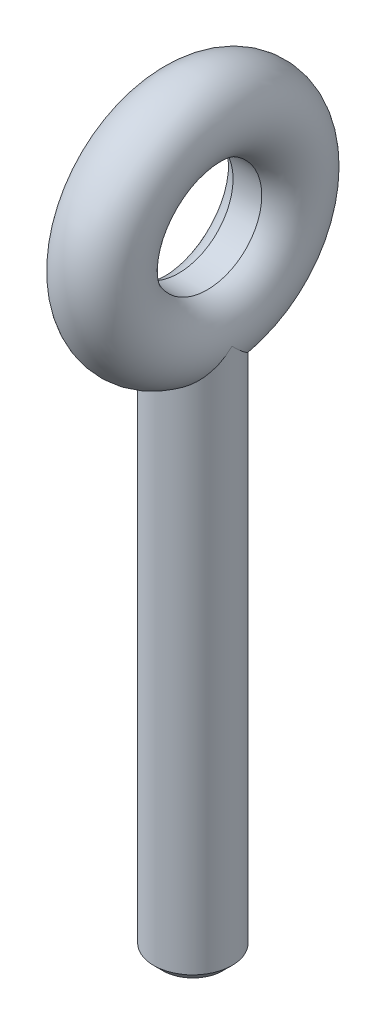
ISO-10303-21;
HEADER;
FILE_DESCRIPTION(('STEP AP214'),'2;1');
FILE_NAME('part.step','',(''),(''),'','','');
FILE_SCHEMA(('AUTOMOTIVE_DESIGN { 1 0 10303 214 1 1 1 1 }'));
ENDSEC;
DATA;
#1=APPLICATION_CONTEXT('core data for automotive mechanical design processes');
#2=APPLICATION_PROTOCOL_DEFINITION('international standard','automotive_design',2000,#1);
#3=PRODUCT_CONTEXT('',#1,'mechanical');
#4=PRODUCT('Part','Part','',(#3));
#5=PRODUCT_RELATED_PRODUCT_CATEGORY('part','',(#4));
#6=PRODUCT_DEFINITION_FORMATION('','',#4);
#7=PRODUCT_DEFINITION_CONTEXT('part definition',#1,'design');
#8=PRODUCT_DEFINITION('design','',#6,#7);
#9=PRODUCT_DEFINITION_SHAPE('','',#8);
#10=(LENGTH_UNIT() NAMED_UNIT(*) SI_UNIT(.MILLI.,.METRE.));
#11=(NAMED_UNIT(*) PLANE_ANGLE_UNIT() SI_UNIT($,.RADIAN.));
#12=(NAMED_UNIT(*) SI_UNIT($,.STERADIAN.) SOLID_ANGLE_UNIT());
#13=UNCERTAINTY_MEASURE_WITH_UNIT(LENGTH_MEASURE(1.E-05),#10,'distance_accuracy_value','');
#14=(GEOMETRIC_REPRESENTATION_CONTEXT(3) GLOBAL_UNCERTAINTY_ASSIGNED_CONTEXT((#13)) GLOBAL_UNIT_ASSIGNED_CONTEXT((#10,
#11,#12)) REPRESENTATION_CONTEXT('',''));
#15=CARTESIAN_POINT('',(0.,0.,0.));
#16=DIRECTION('',(0.,0.,1.));
#17=DIRECTION('',(1.,0.,0.));
#18=AXIS2_PLACEMENT_3D('',#15,#16,#17);
#19=CARTESIAN_POINT('',(0.,0.,0.));
#20=DIRECTION('',(1.,0.,0.));
#21=DIRECTION('',(0.,0.,-1.));
#22=AXIS2_PLACEMENT_3D('',#19,#20,#21);
#23=TOROIDAL_SURFACE('',#22,5.,2.15);
#24=CARTESIAN_POINT('',(0.788986691902974,0.,0.));
#25=DIRECTION('',(-1.,0.,0.));
#26=DIRECTION('',(0.,0.,1.));
#27=AXIS2_PLACEMENT_3D('',#24,#25,#26);
#28=CIRCLE('',#27,3.);
#29=CARTESIAN_POINT('',(0.788986691902974,0.,-3.));
#30=VERTEX_POINT('',#29);
#31=EDGE_CURVE('E55',#30,#30,#28,.F.);
#32=ORIENTED_EDGE('',*,*,#31,.F.);
#33=CARTESIAN_POINT('',(0.,0.,-5.));
#34=DIRECTION('',(0.,1.,0.));
#35=DIRECTION('',(0.,0.,1.));
#36=AXIS2_PLACEMENT_3D('',#33,#34,#35);
#37=CIRCLE('',#36,2.15);
#38=CARTESIAN_POINT('',(-0.788986691902974,0.,-3.));
#39=VERTEX_POINT('',#38);
#40=EDGE_CURVE('E84',#30,#39,#37,.T.);
#41=ORIENTED_EDGE('',*,*,#40,.T.);
#42=CARTESIAN_POINT('',(-0.788986691902974,0.,0.));
#43=DIRECTION('',(1.,0.,0.));
#44=DIRECTION('',(0.,0.,-1.));
#45=AXIS2_PLACEMENT_3D('',#42,#43,#44);
#46=CIRCLE('',#45,3.);
#47=EDGE_CURVE('E66',#39,#39,#46,.F.);
#48=ORIENTED_EDGE('',*,*,#47,.F.);
#49=ORIENTED_EDGE('',*,*,#40,.F.);
#50=EDGE_LOOP('',(#32,#41,#48,#49));
#51=FACE_BOUND('',#50,.T.);
#52=CARTESIAN_POINT('',(2.15000000000003,-5.,0.));
#53=CARTESIAN_POINT('',(2.15000000013928,-5.00218576284556,0.00218575505539729));
#54=CARTESIAN_POINT('',(2.14999666694908,-5.00437086136215,0.00437228710599606));
#55=CARTESIAN_POINT('',(2.14959847574308,-5.13470978131598,0.134882538013936));
#56=CARTESIAN_POINT('',(2.1377100205818,-5.26055841977477,0.265848688861467));
#57=CARTESIAN_POINT('',(2.08806953245431,-5.50557296436792,0.529630557870645));
#58=CARTESIAN_POINT('',(2.05027584405686,-5.62472777249649,0.66244891689495));
#59=CARTESIAN_POINT('',(1.95385191796718,-5.83618951472929,0.905167518111446));
#60=CARTESIAN_POINT('',(1.89925073873636,-5.92982763194926,1.01548875843938));
#61=CARTESIAN_POINT('',(1.76785789965271,-6.10803748099795,1.2300210618427));
#62=CARTESIAN_POINT('',(1.69110301888486,-6.1926239237511,1.33424191050668));
#63=CARTESIAN_POINT('',(1.53132801319288,-6.33511659697673,1.5129615171069));
#64=CARTESIAN_POINT('',(1.45224212415207,-6.3950426192233,1.58935258478108));
#65=CARTESIAN_POINT('',(1.27922553984429,-6.50535003731983,1.73165394954795));
#66=CARTESIAN_POINT('',(1.1852966746525,-6.55573260815476,1.79756553670834));
#67=CARTESIAN_POINT('',(0.982897075735003,-6.64528680298591,1.91578011916827));
#68=CARTESIAN_POINT('',(0.874307328672002,-6.68435744473879,1.96796017819672));
#69=CARTESIAN_POINT('',(0.703482801831961,-6.73245521155908,2.0325698378142));
#70=CARTESIAN_POINT('',(0.645208716104262,-6.74673777703874,2.05183150142316));
#71=CARTESIAN_POINT('',(0.526503424683339,-6.77160575133249,2.08544908606577));
#72=CARTESIAN_POINT('',(0.466072655967832,-6.78219190446247,2.09980599471663));
#73=CARTESIAN_POINT('',(0.300740076504345,-6.80552253693694,2.13149083250758));
#74=CARTESIAN_POINT('',(0.194297051372587,-6.81459775083256,2.14387322384424));
#75=CARTESIAN_POINT('',(-0.0195088580570766,-6.82097785041661,2.15257287502008));
#76=CARTESIAN_POINT('',(-0.12687121459068,-6.81828908945376,2.14889880644387));
#77=CARTESIAN_POINT('',(-0.330014520062422,-6.802039614804,2.12676881752463));
#78=CARTESIAN_POINT('',(-0.426012045192568,-6.78940885251939,2.1095774174238));
#79=CARTESIAN_POINT('',(-0.613238485043717,-6.75498055192937,2.06294679890664));
#80=CARTESIAN_POINT('',(-0.704467248057344,-6.73318272219375,2.0335071911079));
#81=CARTESIAN_POINT('',(-0.883176773581541,-6.68037225354967,1.96266563646699));
#82=CARTESIAN_POINT('',(-0.97042067970535,-6.64906844397523,1.92088705384307));
#83=CARTESIAN_POINT('',(-1.13616624527885,-6.57865896806373,1.82775157043576));
#84=CARTESIAN_POINT('',(-1.21466509362299,-6.53955080422267,1.77639160381742));
#85=CARTESIAN_POINT('',(-1.37134764781242,-6.44929288350054,1.65911006210642));
#86=CARTESIAN_POINT('',(-1.4482483854263,-6.39724709316314,1.59216935710465));
#87=CARTESIAN_POINT('',(-1.58945949087825,-6.28613398331235,1.45123841876185));
#88=CARTESIAN_POINT('',(-1.6537596864597,-6.22706105219307,1.37724256093195));
#89=CARTESIAN_POINT('',(-1.7972970322588,-6.07385905640778,1.18834750939133));
#90=CARTESIAN_POINT('',(-1.86925080096399,-5.9763478794931,1.07063245635577));
#91=CARTESIAN_POINT('',(-1.98762210100293,-5.77200702244666,0.830559686839241));
#92=CARTESIAN_POINT('',(-2.03400155410995,-5.66516371998884,0.708195335884665));
#93=CARTESIAN_POINT('',(-2.09627686793241,-5.4671924130009,0.488247521357761));
#94=CARTESIAN_POINT('',(-2.11646292160545,-5.37730890383668,0.390704702766283));
#95=CARTESIAN_POINT('',(-2.14316325219378,-5.19422334593774,0.19715999971929));
#96=CARTESIAN_POINT('',(-2.14970133477824,-5.10102736439214,0.101155722481519));
#97=CARTESIAN_POINT('',(-2.14999666788939,-5.0043708736834,0.00437230221641141));
#98=CARTESIAN_POINT('',(-2.15000000114442,-5.0021857751435,0.00218577020270674));
#99=CARTESIAN_POINT('',(-2.15000000000003,-5.,0.));
#100=B_SPLINE_CURVE_WITH_KNOTS('',3,(#52,#53,#54,#55,#56,#57,#58,#59,#60,#61,#62,#63,#64,#65,
#66,#67,#68,#69,#70,#71,#72,#73,#74,#75,#76,#77,#78,#79,#80,#81,#82,#83,#84,#85,#86,#87,#88,#89,
#90,#91,#92,#93,#94,#95,#96,#97,#98,#99),.UNSPECIFIED.,.F.,.F.,(4,2,2,2,2,2,2,2,2,2,2,2,2,2,2,2,
2,2,2,2,2,2,2,4),(0.,0.00927362439203138,0.553331980479367,1.09826723721768,1.56056260669665,
2.02209485527434,2.39628840926051,2.77043586273502,3.14782705486921,3.33657881246417,
3.52529254073604,3.84599969678874,4.16653367049147,4.46020689432494,4.75388945502874,
5.05767377883185,5.36155547427275,5.70368106442016,6.04608172056707,6.55015958642137,
7.05498597345224,7.45675492338463,7.85782249448371,7.86709611887846),.UNSPECIFIED.);
#101=CARTESIAN_POINT('',(2.15,-5.,0.));
#102=VERTEX_POINT('',#101);
#103=CARTESIAN_POINT('',(-2.15000000000003,-5.,0.));
#104=VERTEX_POINT('',#103);
#105=EDGE_CURVE('E78',#102,#104,#100,.T.);
#106=ORIENTED_EDGE('',*,*,#105,.F.);
#107=CARTESIAN_POINT('',(-2.15000000000003,-5.,0.));
#108=CARTESIAN_POINT('',(-2.15000000013928,-5.00218576284556,-0.00218575505539727));
#109=CARTESIAN_POINT('',(-2.14999666694908,-5.00437086136215,-0.00437228710599602));
#110=CARTESIAN_POINT('',(-2.14959847574308,-5.13470978131598,-0.134882538013935));
#111=CARTESIAN_POINT('',(-2.1377100205818,-5.26055841977477,-0.265848688861467));
#112=CARTESIAN_POINT('',(-2.08806953245431,-5.50557296436792,-0.529630557870646));
#113=CARTESIAN_POINT('',(-2.05027584405686,-5.62472777249649,-0.66244891689495));
#114=CARTESIAN_POINT('',(-1.95385191796718,-5.83618951472929,-0.905167518111446));
#115=CARTESIAN_POINT('',(-1.89925073873636,-5.92982763194925,-1.01548875843938));
#116=CARTESIAN_POINT('',(-1.76785789965271,-6.10803748099795,-1.2300210618427));
#117=CARTESIAN_POINT('',(-1.69110301888487,-6.1926239237511,-1.33424191050668));
#118=CARTESIAN_POINT('',(-1.53132801319288,-6.33511659697673,-1.5129615171069));
#119=CARTESIAN_POINT('',(-1.45224212415207,-6.3950426192233,-1.58935258478108));
#120=CARTESIAN_POINT('',(-1.27922553984429,-6.50535003731983,-1.73165394954795));
#121=CARTESIAN_POINT('',(-1.1852966746525,-6.55573260815476,-1.79756553670834));
#122=CARTESIAN_POINT('',(-0.982897075735005,-6.64528680298591,-1.91578011916827));
#123=CARTESIAN_POINT('',(-0.874307328672004,-6.68435744473879,-1.96796017819672));
#124=CARTESIAN_POINT('',(-0.703482801831964,-6.73245521155908,-2.0325698378142));
#125=CARTESIAN_POINT('',(-0.645208716104265,-6.74673777703874,-2.05183150142316));
#126=CARTESIAN_POINT('',(-0.526503424683342,-6.77160575133249,-2.08544908606577));
#127=CARTESIAN_POINT('',(-0.466072655967835,-6.78219190446247,-2.09980599471663));
#128=CARTESIAN_POINT('',(-0.300740076504348,-6.80552253693694,-2.13149083250758));
#129=CARTESIAN_POINT('',(-0.194297051372591,-6.81459775083256,-2.14387322384424));
#130=CARTESIAN_POINT('',(0.0195088580570735,-6.82097785041661,-2.15257287502008));
#131=CARTESIAN_POINT('',(0.126871214590677,-6.81828908945375,-2.14889880644387));
#132=CARTESIAN_POINT('',(0.330014520062419,-6.802039614804,-2.12676881752463));
#133=CARTESIAN_POINT('',(0.426012045192565,-6.78940885251939,-2.1095774174238));
#134=CARTESIAN_POINT('',(0.613238485043714,-6.75498055192937,-2.06294679890665));
#135=CARTESIAN_POINT('',(0.704467248057341,-6.73318272219375,-2.0335071911079));
#136=CARTESIAN_POINT('',(0.883176773581538,-6.68037225354967,-1.96266563646699));
#137=CARTESIAN_POINT('',(0.970420679705346,-6.64906844397523,-1.92088705384307));
#138=CARTESIAN_POINT('',(1.13616624527884,-6.57865896806373,-1.82775157043577));
#139=CARTESIAN_POINT('',(1.21466509362299,-6.53955080422267,-1.77639160381742));
#140=CARTESIAN_POINT('',(1.37134764781242,-6.44929288350054,-1.65911006210642));
#141=CARTESIAN_POINT('',(1.4482483854263,-6.39724709316314,-1.59216935710465));
#142=CARTESIAN_POINT('',(1.58945949087825,-6.28613398331235,-1.45123841876185));
#143=CARTESIAN_POINT('',(1.6537596864597,-6.22706105219308,-1.37724256093195));
#144=CARTESIAN_POINT('',(1.79729703225879,-6.07385905640778,-1.18834750939135));
#145=CARTESIAN_POINT('',(1.86925080096398,-5.97634787949309,-1.07063245635584));
#146=CARTESIAN_POINT('',(1.98762210100291,-5.77200702244673,-0.830559686839231));
#147=CARTESIAN_POINT('',(2.03400155410994,-5.665163719989,-0.70819533588453));
#148=CARTESIAN_POINT('',(2.09627686793241,-5.46719241300077,-0.488247521357873));
#149=CARTESIAN_POINT('',(2.11646292160546,-5.37730890383625,-0.390704702766671));
#150=CARTESIAN_POINT('',(2.14316325219378,-5.19422334593812,-0.197159999718858));
#151=CARTESIAN_POINT('',(2.14970133477824,-5.10102736439365,-0.101155722479993));
#152=CARTESIAN_POINT('',(2.14999666788939,-5.00437087368348,-0.00437230221634479));
#153=CARTESIAN_POINT('',(2.15000000114442,-5.00218577514354,-0.00218577020267274));
#154=CARTESIAN_POINT('',(2.15000000000003,-5.,0.));
#155=B_SPLINE_CURVE_WITH_KNOTS('',3,(#107,#108,#109,#110,#111,#112,#113,#114,#115,#116,#117,
#118,#119,#120,#121,#122,#123,#124,#125,#126,#127,#128,#129,#130,#131,#132,#133,#134,#135,#136,
#137,#138,#139,#140,#141,#142,#143,#144,#145,#146,#147,#148,#149,#150,#151,#152,#153,#154),
.UNSPECIFIED.,.F.,.F.,(4,2,2,2,2,2,2,2,2,2,2,2,2,2,2,2,2,2,2,2,2,2,2,4),(0.,0.00927362439203133,
0.553331980479367,1.09826723721768,1.56056260669665,2.02209485527434,2.39628840926051,
2.77043586273502,3.14782705486921,3.33657881246417,3.52529254073604,3.84599969678873,
4.16653367049147,4.46020689432494,4.75388945502874,5.05767377883185,5.36155547427275,
5.70368106442016,6.04608172056707,6.55015958642131,7.05498597345224,7.45675492338469,
7.8578224944837,7.86709611887846),.UNSPECIFIED.);
#156=EDGE_CURVE('E80',#104,#102,#155,.T.);
#157=ORIENTED_EDGE('',*,*,#156,.F.);
#158=EDGE_LOOP('',(#106,#157));
#159=FACE_BOUND('',#158,.T.);
#160=ADVANCED_FACE('F51',(#51,#159),#23,.T.);
#161=CARTESIAN_POINT('',(0.,-35.,0.));
#162=DIRECTION('',(0.,-1.,0.));
#163=DIRECTION('',(0.,0.,-1.));
#164=AXIS2_PLACEMENT_3D('',#161,#162,#163);
#165=PLANE('',#164);
#166=CARTESIAN_POINT('',(0.,-35.,0.));
#167=DIRECTION('',(0.,-1.,0.));
#168=DIRECTION('',(0.,0.,-1.));
#169=AXIS2_PLACEMENT_3D('',#166,#167,#168);
#170=CIRCLE('',#169,1.65);
#171=CARTESIAN_POINT('',(0.,-35.,-1.65));
#172=VERTEX_POINT('',#171);
#173=EDGE_CURVE('E60',#172,#172,#170,.T.);
#174=ORIENTED_EDGE('',*,*,#173,.T.);
#175=EDGE_LOOP('',(#174));
#176=FACE_BOUND('',#175,.T.);
#177=ADVANCED_FACE('F101',(#176),#165,.T.);
#178=CARTESIAN_POINT('',(0.,-5.,0.));
#179=DIRECTION('',(0.,-1.,0.));
#180=DIRECTION('',(0.,0.,-1.));
#181=AXIS2_PLACEMENT_3D('',#178,#179,#180);
#182=CYLINDRICAL_SURFACE('',#181,2.15);
#183=CARTESIAN_POINT('',(0.,-34.5,0.));
#184=DIRECTION('',(0.,-1.,0.));
#185=DIRECTION('',(0.,0.,-1.));
#186=AXIS2_PLACEMENT_3D('',#183,#184,#185);
#187=CIRCLE('',#186,2.15);
#188=CARTESIAN_POINT('',(0.,-34.5,-2.15));
#189=VERTEX_POINT('',#188);
#190=EDGE_CURVE('E12',#189,#189,#187,.F.);
#191=ORIENTED_EDGE('',*,*,#190,.T.);
#192=EDGE_LOOP('',(#191));
#193=FACE_BOUND('',#192,.T.);
#194=ORIENTED_EDGE('',*,*,#156,.T.);
#195=ORIENTED_EDGE('',*,*,#105,.T.);
#196=EDGE_LOOP('',(#194,#195));
#197=FACE_BOUND('',#196,.T.);
#198=ADVANCED_FACE('F83',(#193,#197),#182,.T.);
#199=CARTESIAN_POINT('',(0.,-35.,0.));
#200=DIRECTION('',(0.,1.,0.));
#201=DIRECTION('',(0.,0.,1.));
#202=AXIS2_PLACEMENT_3D('',#199,#200,#201);
#203=CONICAL_SURFACE('',#202,1.65,0.785398163397457);
#204=ORIENTED_EDGE('',*,*,#190,.F.);
#205=EDGE_LOOP('',(#204));
#206=FACE_BOUND('',#205,.T.);
#207=ORIENTED_EDGE('',*,*,#173,.F.);
#208=EDGE_LOOP('',(#207));
#209=FACE_BOUND('',#208,.T.);
#210=ADVANCED_FACE('F53',(#206,#209),#203,.T.);
#211=CARTESIAN_POINT('',(-2.15,0.,0.));
#212=DIRECTION('',(1.,0.,0.));
#213=DIRECTION('',(0.,0.,-1.));
#214=AXIS2_PLACEMENT_3D('',#211,#212,#213);
#215=CYLINDRICAL_SURFACE('',#214,3.);
#216=ORIENTED_EDGE('',*,*,#31,.T.);
#217=EDGE_LOOP('',(#216));
#218=FACE_BOUND('',#217,.T.);
#219=ORIENTED_EDGE('',*,*,#47,.T.);
#220=EDGE_LOOP('',(#219));
#221=FACE_BOUND('',#220,.T.);
#222=ADVANCED_FACE('F103',(#218,#221),#215,.F.);
#223=CLOSED_SHELL('',(#160,#177,#198,#210,#222));
#224=MANIFOLD_SOLID_BREP('B2',#223);
#225=ADVANCED_BREP_SHAPE_REPRESENTATION('',(#18,#224),#14);
#226=SHAPE_DEFINITION_REPRESENTATION(#9,#225);
ENDSEC;
END-ISO-10303-21;
